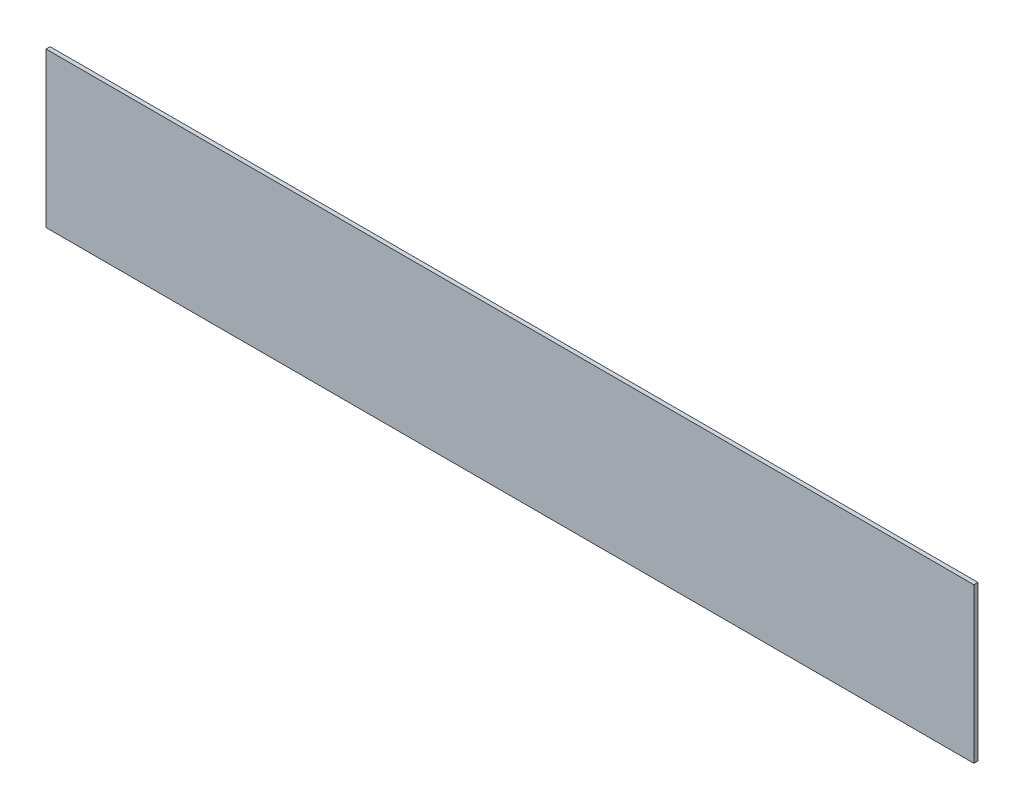
ISO-10303-21;
HEADER;
FILE_DESCRIPTION(('STEP AP214'),'2;1');
FILE_NAME('part.step','',(''),(''),'','','');
FILE_SCHEMA(('AUTOMOTIVE_DESIGN { 1 0 10303 214 1 1 1 1 }'));
ENDSEC;
DATA;
#1=APPLICATION_CONTEXT('core data for automotive mechanical design processes');
#2=APPLICATION_PROTOCOL_DEFINITION('international standard','automotive_design',2000,#1);
#3=PRODUCT_CONTEXT('',#1,'mechanical');
#4=PRODUCT('Part','Part','',(#3));
#5=PRODUCT_RELATED_PRODUCT_CATEGORY('part','',(#4));
#6=PRODUCT_DEFINITION_FORMATION('','',#4);
#7=PRODUCT_DEFINITION_CONTEXT('part definition',#1,'design');
#8=PRODUCT_DEFINITION('design','',#6,#7);
#9=PRODUCT_DEFINITION_SHAPE('','',#8);
#10=(LENGTH_UNIT() NAMED_UNIT(*) SI_UNIT(.MILLI.,.METRE.));
#11=(NAMED_UNIT(*) PLANE_ANGLE_UNIT() SI_UNIT($,.RADIAN.));
#12=(NAMED_UNIT(*) SI_UNIT($,.STERADIAN.) SOLID_ANGLE_UNIT());
#13=UNCERTAINTY_MEASURE_WITH_UNIT(LENGTH_MEASURE(1.E-05),#10,'distance_accuracy_value','');
#14=(GEOMETRIC_REPRESENTATION_CONTEXT(3) GLOBAL_UNCERTAINTY_ASSIGNED_CONTEXT((#13)) GLOBAL_UNIT_ASSIGNED_CONTEXT((#10,
#11,#12)) REPRESENTATION_CONTEXT('',''));
#15=CARTESIAN_POINT('',(0.,0.,0.));
#16=DIRECTION('',(0.,0.,1.));
#17=DIRECTION('',(1.,0.,0.));
#18=AXIS2_PLACEMENT_3D('',#15,#16,#17);
#19=CARTESIAN_POINT('',(228.6,38.1,2.));
#20=DIRECTION('',(-1.,0.,0.));
#21=DIRECTION('',(0.,0.,1.));
#22=AXIS2_PLACEMENT_3D('',#19,#20,#21);
#23=PLANE('',#22);
#24=DIRECTION('',(0.,1.,0.));
#25=VECTOR('',#24,1.);
#26=CARTESIAN_POINT('',(228.6,38.1,0.));
#27=LINE('',#26,#25);
#28=CARTESIAN_POINT('',(228.6,-38.1,0.));
#29=VERTEX_POINT('',#28);
#30=CARTESIAN_POINT('',(228.6,38.1,0.));
#31=VERTEX_POINT('',#30);
#32=EDGE_CURVE('E97',#29,#31,#27,.T.);
#33=ORIENTED_EDGE('',*,*,#32,.T.);
#34=DIRECTION('',(0.,0.,-1.));
#35=VECTOR('',#34,1.);
#36=CARTESIAN_POINT('',(228.6,38.1,2.));
#37=LINE('',#36,#35);
#38=CARTESIAN_POINT('',(228.6,38.1,2.));
#39=VERTEX_POINT('',#38);
#40=EDGE_CURVE('E11',#39,#31,#37,.T.);
#41=ORIENTED_EDGE('',*,*,#40,.F.);
#42=DIRECTION('',(0.,1.,0.));
#43=VECTOR('',#42,1.);
#44=CARTESIAN_POINT('',(228.6,38.1,2.));
#45=LINE('',#44,#43);
#46=CARTESIAN_POINT('',(228.6,-38.1,2.));
#47=VERTEX_POINT('',#46);
#48=EDGE_CURVE('E85',#47,#39,#45,.T.);
#49=ORIENTED_EDGE('',*,*,#48,.F.);
#50=DIRECTION('',(0.,0.,-1.));
#51=VECTOR('',#50,1.);
#52=CARTESIAN_POINT('',(228.6,-38.1,2.));
#53=LINE('',#52,#51);
#54=EDGE_CURVE('E93',#47,#29,#53,.T.);
#55=ORIENTED_EDGE('',*,*,#54,.T.);
#56=EDGE_LOOP('',(#33,#41,#49,#55));
#57=FACE_BOUND('',#56,.T.);
#58=ADVANCED_FACE('F34',(#57),#23,.F.);
#59=CARTESIAN_POINT('',(-228.6,38.1,2.));
#60=DIRECTION('',(0.,-1.,0.));
#61=DIRECTION('',(0.,0.,-1.));
#62=AXIS2_PLACEMENT_3D('',#59,#60,#61);
#63=PLANE('',#62);
#64=DIRECTION('',(-1.,0.,0.));
#65=VECTOR('',#64,1.);
#66=CARTESIAN_POINT('',(-228.6,38.1,0.));
#67=LINE('',#66,#65);
#68=CARTESIAN_POINT('',(-228.6,38.1,0.));
#69=VERTEX_POINT('',#68);
#70=EDGE_CURVE('E89',#31,#69,#67,.T.);
#71=ORIENTED_EDGE('',*,*,#70,.T.);
#72=DIRECTION('',(0.,0.,-1.));
#73=VECTOR('',#72,1.);
#74=CARTESIAN_POINT('',(-228.6,38.1,2.));
#75=LINE('',#74,#73);
#76=CARTESIAN_POINT('',(-228.6,38.1,2.));
#77=VERTEX_POINT('',#76);
#78=EDGE_CURVE('E42',#77,#69,#75,.T.);
#79=ORIENTED_EDGE('',*,*,#78,.F.);
#80=DIRECTION('',(-1.,0.,0.));
#81=VECTOR('',#80,1.);
#82=CARTESIAN_POINT('',(-228.6,38.1,2.));
#83=LINE('',#82,#81);
#84=EDGE_CURVE('E80',#39,#77,#83,.T.);
#85=ORIENTED_EDGE('',*,*,#84,.F.);
#86=ORIENTED_EDGE('',*,*,#40,.T.);
#87=EDGE_LOOP('',(#71,#79,#85,#86));
#88=FACE_BOUND('',#87,.T.);
#89=ADVANCED_FACE('F88',(#88),#63,.F.);
#90=CARTESIAN_POINT('',(-228.6,38.1,2.));
#91=DIRECTION('',(1.,0.,0.));
#92=DIRECTION('',(0.,0.,-1.));
#93=AXIS2_PLACEMENT_3D('',#90,#91,#92);
#94=PLANE('',#93);
#95=DIRECTION('',(0.,-1.,0.));
#96=VECTOR('',#95,1.);
#97=CARTESIAN_POINT('',(-228.6,38.1,0.));
#98=LINE('',#97,#96);
#99=CARTESIAN_POINT('',(-228.6,-38.1,0.));
#100=VERTEX_POINT('',#99);
#101=EDGE_CURVE('E67',#69,#100,#98,.T.);
#102=ORIENTED_EDGE('',*,*,#101,.T.);
#103=DIRECTION('',(0.,0.,-1.));
#104=VECTOR('',#103,1.);
#105=CARTESIAN_POINT('',(-228.6,-38.1,2.));
#106=LINE('',#105,#104);
#107=CARTESIAN_POINT('',(-228.6,-38.1,2.));
#108=VERTEX_POINT('',#107);
#109=EDGE_CURVE('E90',#108,#100,#106,.T.);
#110=ORIENTED_EDGE('',*,*,#109,.F.);
#111=DIRECTION('',(0.,-1.,0.));
#112=VECTOR('',#111,1.);
#113=CARTESIAN_POINT('',(-228.6,38.1,2.));
#114=LINE('',#113,#112);
#115=EDGE_CURVE('E83',#77,#108,#114,.T.);
#116=ORIENTED_EDGE('',*,*,#115,.F.);
#117=ORIENTED_EDGE('',*,*,#78,.T.);
#118=EDGE_LOOP('',(#102,#110,#116,#117));
#119=FACE_BOUND('',#118,.T.);
#120=ADVANCED_FACE('F91',(#119),#94,.F.);
#121=CARTESIAN_POINT('',(-228.6,-38.1,2.));
#122=DIRECTION('',(0.,1.,0.));
#123=DIRECTION('',(0.,0.,1.));
#124=AXIS2_PLACEMENT_3D('',#121,#122,#123);
#125=PLANE('',#124);
#126=DIRECTION('',(1.,0.,0.));
#127=VECTOR('',#126,1.);
#128=CARTESIAN_POINT('',(-228.6,-38.1,0.));
#129=LINE('',#128,#127);
#130=EDGE_CURVE('E73',#100,#29,#129,.T.);
#131=ORIENTED_EDGE('',*,*,#130,.T.);
#132=ORIENTED_EDGE('',*,*,#54,.F.);
#133=DIRECTION('',(1.,0.,0.));
#134=VECTOR('',#133,1.);
#135=CARTESIAN_POINT('',(-228.6,-38.1,2.));
#136=LINE('',#135,#134);
#137=EDGE_CURVE('E50',#108,#47,#136,.T.);
#138=ORIENTED_EDGE('',*,*,#137,.F.);
#139=ORIENTED_EDGE('',*,*,#109,.T.);
#140=EDGE_LOOP('',(#131,#132,#138,#139));
#141=FACE_BOUND('',#140,.T.);
#142=ADVANCED_FACE('F104',(#141),#125,.F.);
#143=CARTESIAN_POINT('',(0.,0.,2.));
#144=DIRECTION('',(0.,0.,1.));
#145=DIRECTION('',(1.,0.,0.));
#146=AXIS2_PLACEMENT_3D('',#143,#144,#145);
#147=PLANE('',#146);
#148=ORIENTED_EDGE('',*,*,#48,.T.);
#149=ORIENTED_EDGE('',*,*,#84,.T.);
#150=ORIENTED_EDGE('',*,*,#115,.T.);
#151=ORIENTED_EDGE('',*,*,#137,.T.);
#152=EDGE_LOOP('',(#148,#149,#150,#151));
#153=FACE_BOUND('',#152,.T.);
#154=ADVANCED_FACE('F81',(#153),#147,.T.);
#155=CARTESIAN_POINT('',(0.,0.,0.));
#156=DIRECTION('',(0.,0.,1.));
#157=DIRECTION('',(1.,0.,0.));
#158=AXIS2_PLACEMENT_3D('',#155,#156,#157);
#159=PLANE('',#158);
#160=ORIENTED_EDGE('',*,*,#32,.F.);
#161=ORIENTED_EDGE('',*,*,#130,.F.);
#162=ORIENTED_EDGE('',*,*,#101,.F.);
#163=ORIENTED_EDGE('',*,*,#70,.F.);
#164=EDGE_LOOP('',(#160,#161,#162,#163));
#165=FACE_BOUND('',#164,.T.);
#166=ADVANCED_FACE('F107',(#165),#159,.F.);
#167=CLOSED_SHELL('',(#58,#89,#120,#142,#154,#166));
#168=MANIFOLD_SOLID_BREP('B2',#167);
#169=ADVANCED_BREP_SHAPE_REPRESENTATION('',(#18,#168),#14);
#170=SHAPE_DEFINITION_REPRESENTATION(#9,#169);
ENDSEC;
END-ISO-10303-21;
